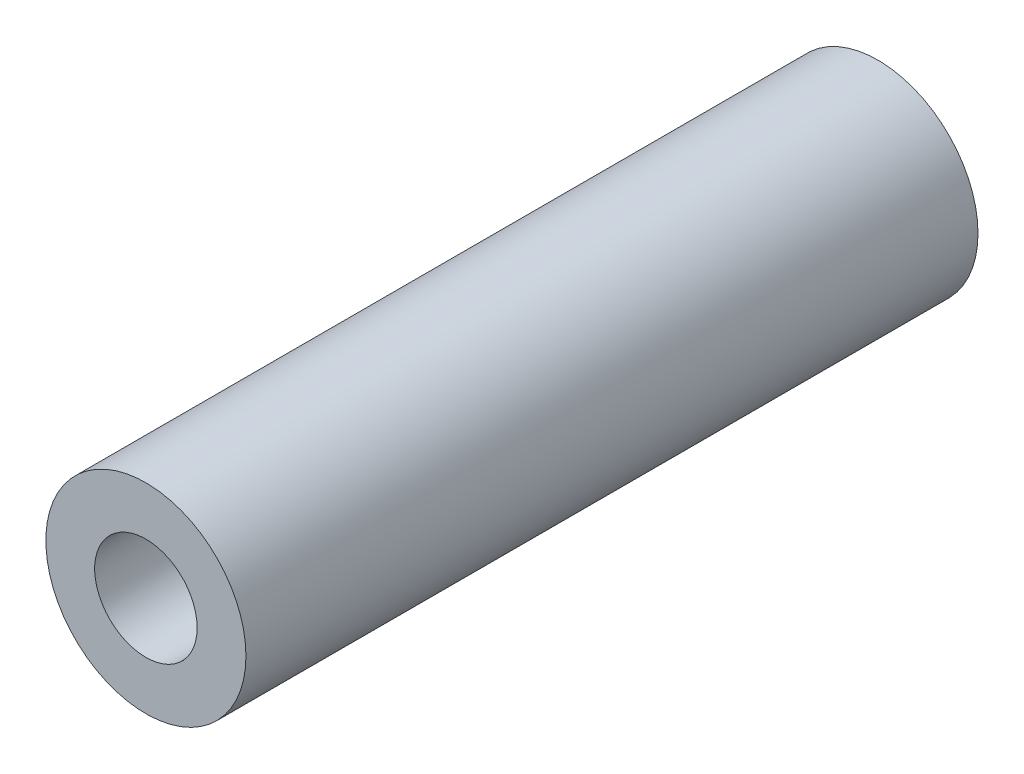
ISO-10303-21;
HEADER;
FILE_DESCRIPTION(('STEP AP214'),'2;1');
FILE_NAME('part.step','',(''),(''),'','','');
FILE_SCHEMA(('AUTOMOTIVE_DESIGN { 1 0 10303 214 1 1 1 1 }'));
ENDSEC;
DATA;
#1=APPLICATION_CONTEXT('core data for automotive mechanical design processes');
#2=APPLICATION_PROTOCOL_DEFINITION('international standard','automotive_design',2000,#1);
#3=PRODUCT_CONTEXT('',#1,'mechanical');
#4=PRODUCT('Part','Part','',(#3));
#5=PRODUCT_RELATED_PRODUCT_CATEGORY('part','',(#4));
#6=PRODUCT_DEFINITION_FORMATION('','',#4);
#7=PRODUCT_DEFINITION_CONTEXT('part definition',#1,'design');
#8=PRODUCT_DEFINITION('design','',#6,#7);
#9=PRODUCT_DEFINITION_SHAPE('','',#8);
#10=(LENGTH_UNIT() NAMED_UNIT(*) SI_UNIT(.MILLI.,.METRE.));
#11=(NAMED_UNIT(*) PLANE_ANGLE_UNIT() SI_UNIT($,.RADIAN.));
#12=(NAMED_UNIT(*) SI_UNIT($,.STERADIAN.) SOLID_ANGLE_UNIT());
#13=UNCERTAINTY_MEASURE_WITH_UNIT(LENGTH_MEASURE(1.E-05),#10,'distance_accuracy_value','');
#14=(GEOMETRIC_REPRESENTATION_CONTEXT(3) GLOBAL_UNCERTAINTY_ASSIGNED_CONTEXT((#13)) GLOBAL_UNIT_ASSIGNED_CONTEXT((#10,
#11,#12)) REPRESENTATION_CONTEXT('',''));
#15=CARTESIAN_POINT('',(0.,0.,0.));
#16=DIRECTION('',(0.,0.,1.));
#17=DIRECTION('',(1.,0.,0.));
#18=AXIS2_PLACEMENT_3D('',#15,#16,#17);
#19=CARTESIAN_POINT('',(0.,0.,30.));
#20=DIRECTION('',(0.,0.,-1.));
#21=DIRECTION('',(-1.,0.,0.));
#22=AXIS2_PLACEMENT_3D('',#19,#20,#21);
#23=CYLINDRICAL_SURFACE('',#22,2.1);
#24=CARTESIAN_POINT('',(0.,0.,30.));
#25=DIRECTION('',(0.,0.,1.));
#26=DIRECTION('',(1.,0.,0.));
#27=AXIS2_PLACEMENT_3D('',#24,#25,#26);
#28=CIRCLE('',#27,2.1);
#29=CARTESIAN_POINT('',(2.1,0.,30.));
#30=VERTEX_POINT('',#29);
#31=EDGE_CURVE('E44',#30,#30,#28,.T.);
#32=ORIENTED_EDGE('',*,*,#31,.T.);
#33=EDGE_LOOP('',(#32));
#34=FACE_BOUND('',#33,.T.);
#35=CARTESIAN_POINT('',(0.,0.,0.));
#36=DIRECTION('',(0.,0.,1.));
#37=DIRECTION('',(1.,0.,0.));
#38=AXIS2_PLACEMENT_3D('',#35,#36,#37);
#39=CIRCLE('',#38,2.1);
#40=CARTESIAN_POINT('',(2.1,0.,0.));
#41=VERTEX_POINT('',#40);
#42=EDGE_CURVE('E50',#41,#41,#39,.T.);
#43=ORIENTED_EDGE('',*,*,#42,.F.);
#44=EDGE_LOOP('',(#43));
#45=FACE_BOUND('',#44,.T.);
#46=ADVANCED_FACE('F37',(#34,#45),#23,.F.);
#47=CARTESIAN_POINT('',(0.,0.,30.));
#48=DIRECTION('',(0.,0.,-1.));
#49=DIRECTION('',(-1.,0.,0.));
#50=AXIS2_PLACEMENT_3D('',#47,#48,#49);
#51=CYLINDRICAL_SURFACE('',#50,4.1);
#52=CARTESIAN_POINT('',(0.,0.,30.));
#53=DIRECTION('',(0.,0.,1.));
#54=DIRECTION('',(1.,0.,0.));
#55=AXIS2_PLACEMENT_3D('',#52,#53,#54);
#56=CIRCLE('',#55,4.1);
#57=CARTESIAN_POINT('',(4.1,0.,30.));
#58=VERTEX_POINT('',#57);
#59=EDGE_CURVE('E10',#58,#58,#56,.T.);
#60=ORIENTED_EDGE('',*,*,#59,.F.);
#61=EDGE_LOOP('',(#60));
#62=FACE_BOUND('',#61,.T.);
#63=CARTESIAN_POINT('',(0.,0.,0.));
#64=DIRECTION('',(0.,0.,1.));
#65=DIRECTION('',(1.,0.,0.));
#66=AXIS2_PLACEMENT_3D('',#63,#64,#65);
#67=CIRCLE('',#66,4.1);
#68=CARTESIAN_POINT('',(4.1,0.,0.));
#69=VERTEX_POINT('',#68);
#70=EDGE_CURVE('E40',#69,#69,#67,.T.);
#71=ORIENTED_EDGE('',*,*,#70,.T.);
#72=EDGE_LOOP('',(#71));
#73=FACE_BOUND('',#72,.T.);
#74=ADVANCED_FACE('F57',(#62,#73),#51,.T.);
#75=CARTESIAN_POINT('',(0.,0.,30.));
#76=DIRECTION('',(0.,0.,1.));
#77=DIRECTION('',(1.,0.,0.));
#78=AXIS2_PLACEMENT_3D('',#75,#76,#77);
#79=PLANE('',#78);
#80=ORIENTED_EDGE('',*,*,#31,.F.);
#81=EDGE_LOOP('',(#80));
#82=FACE_BOUND('',#81,.T.);
#83=ORIENTED_EDGE('',*,*,#59,.T.);
#84=EDGE_LOOP('',(#83));
#85=FACE_BOUND('',#84,.T.);
#86=ADVANCED_FACE('F61',(#82,#85),#79,.T.);
#87=CARTESIAN_POINT('',(0.,0.,0.));
#88=DIRECTION('',(0.,0.,1.));
#89=DIRECTION('',(1.,0.,0.));
#90=AXIS2_PLACEMENT_3D('',#87,#88,#89);
#91=PLANE('',#90);
#92=ORIENTED_EDGE('',*,*,#42,.T.);
#93=EDGE_LOOP('',(#92));
#94=FACE_BOUND('',#93,.T.);
#95=ORIENTED_EDGE('',*,*,#70,.F.);
#96=EDGE_LOOP('',(#95));
#97=FACE_BOUND('',#96,.T.);
#98=ADVANCED_FACE('F59',(#94,#97),#91,.F.);
#99=CLOSED_SHELL('',(#46,#74,#86,#98));
#100=MANIFOLD_SOLID_BREP('B2',#99);
#101=ADVANCED_BREP_SHAPE_REPRESENTATION('',(#18,#100),#14);
#102=SHAPE_DEFINITION_REPRESENTATION(#9,#101);
ENDSEC;
END-ISO-10303-21;
